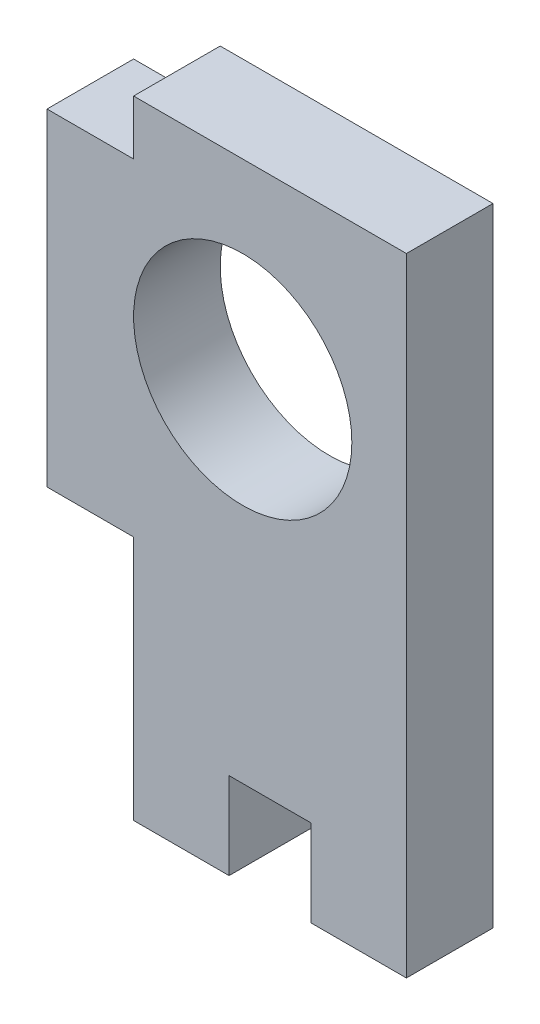
ISO-10303-21;
HEADER;
FILE_DESCRIPTION(('STEP AP214'),'2;1');
FILE_NAME('part.step','',(''),(''),'','','');
FILE_SCHEMA(('AUTOMOTIVE_DESIGN { 1 0 10303 214 1 1 1 1 }'));
ENDSEC;
DATA;
#1=APPLICATION_CONTEXT('core data for automotive mechanical design processes');
#2=APPLICATION_PROTOCOL_DEFINITION('international standard','automotive_design',2000,#1);
#3=PRODUCT_CONTEXT('',#1,'mechanical');
#4=PRODUCT('Part','Part','',(#3));
#5=PRODUCT_RELATED_PRODUCT_CATEGORY('part','',(#4));
#6=PRODUCT_DEFINITION_FORMATION('','',#4);
#7=PRODUCT_DEFINITION_CONTEXT('part definition',#1,'design');
#8=PRODUCT_DEFINITION('design','',#6,#7);
#9=PRODUCT_DEFINITION_SHAPE('','',#8);
#10=(LENGTH_UNIT() NAMED_UNIT(*) SI_UNIT(.MILLI.,.METRE.));
#11=(NAMED_UNIT(*) PLANE_ANGLE_UNIT() SI_UNIT($,.RADIAN.));
#12=(NAMED_UNIT(*) SI_UNIT($,.STERADIAN.) SOLID_ANGLE_UNIT());
#13=UNCERTAINTY_MEASURE_WITH_UNIT(LENGTH_MEASURE(1.E-05),#10,'distance_accuracy_value','');
#14=(GEOMETRIC_REPRESENTATION_CONTEXT(3) GLOBAL_UNCERTAINTY_ASSIGNED_CONTEXT((#13)) GLOBAL_UNIT_ASSIGNED_CONTEXT((#10,
#11,#12)) REPRESENTATION_CONTEXT('',''));
#15=CARTESIAN_POINT('',(0.,0.,0.));
#16=DIRECTION('',(0.,0.,1.));
#17=DIRECTION('',(1.,0.,0.));
#18=AXIS2_PLACEMENT_3D('',#15,#16,#17);
#19=CARTESIAN_POINT('',(-5.,9.5,-3.175));
#20=DIRECTION('',(1.,0.,0.));
#21=DIRECTION('',(0.,1.,0.));
#22=AXIS2_PLACEMENT_3D('',#19,#20,#21);
#23=PLANE('',#22);
#24=DIRECTION('',(0.,1.,0.));
#25=VECTOR('',#24,1.);
#26=CARTESIAN_POINT('',(-5.,9.5,0.));
#27=LINE('',#26,#25);
#28=CARTESIAN_POINT('',(-5.,9.5,0.));
#29=VERTEX_POINT('',#28);
#30=CARTESIAN_POINT('',(-5.,11.5,0.));
#31=VERTEX_POINT('',#30);
#32=EDGE_CURVE('E198',#29,#31,#27,.T.);
#33=ORIENTED_EDGE('',*,*,#32,.T.);
#34=DIRECTION('',(0.,0.,1.));
#35=VECTOR('',#34,1.);
#36=CARTESIAN_POINT('',(-5.,11.5,-3.175));
#37=LINE('',#36,#35);
#38=CARTESIAN_POINT('',(-5.,11.5,-3.175));
#39=VERTEX_POINT('',#38);
#40=EDGE_CURVE('E12',#39,#31,#37,.T.);
#41=ORIENTED_EDGE('',*,*,#40,.F.);
#42=DIRECTION('',(0.,1.,0.));
#43=VECTOR('',#42,1.);
#44=CARTESIAN_POINT('',(-5.,9.5,-3.175));
#45=LINE('',#44,#43);
#46=CARTESIAN_POINT('',(-5.,9.5,-3.175));
#47=VERTEX_POINT('',#46);
#48=EDGE_CURVE('E231',#47,#39,#45,.T.);
#49=ORIENTED_EDGE('',*,*,#48,.F.);
#50=DIRECTION('',(0.,0.,1.));
#51=VECTOR('',#50,1.);
#52=CARTESIAN_POINT('',(-5.,9.5,-3.175));
#53=LINE('',#52,#51);
#54=EDGE_CURVE('E93',#47,#29,#53,.T.);
#55=ORIENTED_EDGE('',*,*,#54,.T.);
#56=EDGE_LOOP('',(#33,#41,#49,#55));
#57=FACE_BOUND('',#56,.T.);
#58=ADVANCED_FACE('F77',(#57),#23,.F.);
#59=CARTESIAN_POINT('',(1.5,11.5,-3.175));
#60=DIRECTION('',(0.,-1.,0.));
#61=DIRECTION('',(1.,0.,0.));
#62=AXIS2_PLACEMENT_3D('',#59,#60,#61);
#63=PLANE('',#62);
#64=DIRECTION('',(1.,0.,0.));
#65=VECTOR('',#64,1.);
#66=CARTESIAN_POINT('',(1.5,11.5,0.));
#67=LINE('',#66,#65);
#68=CARTESIAN_POINT('',(5.,11.5,0.));
#69=VERTEX_POINT('',#68);
#70=EDGE_CURVE('E200',#31,#69,#67,.T.);
#71=ORIENTED_EDGE('',*,*,#70,.T.);
#72=DIRECTION('',(0.,0.,1.));
#73=VECTOR('',#72,1.);
#74=CARTESIAN_POINT('',(5.,11.5,-3.175));
#75=LINE('',#74,#73);
#76=CARTESIAN_POINT('',(5.,11.5,-3.175));
#77=VERTEX_POINT('',#76);
#78=EDGE_CURVE('E85',#77,#69,#75,.T.);
#79=ORIENTED_EDGE('',*,*,#78,.F.);
#80=DIRECTION('',(1.,0.,0.));
#81=VECTOR('',#80,1.);
#82=CARTESIAN_POINT('',(-5.,11.5,-3.175));
#83=LINE('',#82,#81);
#84=EDGE_CURVE('E143',#39,#77,#83,.T.);
#85=ORIENTED_EDGE('',*,*,#84,.F.);
#86=ORIENTED_EDGE('',*,*,#40,.T.);
#87=EDGE_LOOP('',(#71,#79,#85,#86));
#88=FACE_BOUND('',#87,.T.);
#89=ADVANCED_FACE('F252',(#88),#63,.F.);
#90=CARTESIAN_POINT('',(5.,-11.5,-3.175));
#91=DIRECTION('',(1.,0.,0.));
#92=DIRECTION('',(0.,0.,-1.));
#93=AXIS2_PLACEMENT_3D('',#90,#91,#92);
#94=PLANE('',#93);
#95=DIRECTION('',(0.,1.,0.));
#96=VECTOR('',#95,1.);
#97=CARTESIAN_POINT('',(5.,-11.5,0.));
#98=LINE('',#97,#96);
#99=CARTESIAN_POINT('',(5.,-11.5,0.));
#100=VERTEX_POINT('',#99);
#101=EDGE_CURVE('E204',#100,#69,#98,.T.);
#102=ORIENTED_EDGE('',*,*,#101,.F.);
#103=DIRECTION('',(0.,0.,1.));
#104=VECTOR('',#103,1.);
#105=CARTESIAN_POINT('',(5.,-11.5,-3.175));
#106=LINE('',#105,#104);
#107=CARTESIAN_POINT('',(5.,-11.5,-3.175));
#108=VERTEX_POINT('',#107);
#109=EDGE_CURVE('E245',#108,#100,#106,.T.);
#110=ORIENTED_EDGE('',*,*,#109,.F.);
#111=DIRECTION('',(0.,1.,0.));
#112=VECTOR('',#111,1.);
#113=CARTESIAN_POINT('',(5.,-11.5,-3.175));
#114=LINE('',#113,#112);
#115=EDGE_CURVE('E251',#108,#77,#114,.T.);
#116=ORIENTED_EDGE('',*,*,#115,.T.);
#117=ORIENTED_EDGE('',*,*,#78,.T.);
#118=EDGE_LOOP('',(#102,#110,#116,#117));
#119=FACE_BOUND('',#118,.T.);
#120=ADVANCED_FACE('F249',(#119),#94,.T.);
#121=CARTESIAN_POINT('',(1.5,-11.5,-3.175));
#122=DIRECTION('',(0.,-1.,0.));
#123=DIRECTION('',(0.,0.,-1.));
#124=AXIS2_PLACEMENT_3D('',#121,#122,#123);
#125=PLANE('',#124);
#126=DIRECTION('',(1.,0.,0.));
#127=VECTOR('',#126,1.);
#128=CARTESIAN_POINT('',(1.5,-11.5,0.));
#129=LINE('',#128,#127);
#130=CARTESIAN_POINT('',(1.5,-11.5,0.));
#131=VERTEX_POINT('',#130);
#132=EDGE_CURVE('E207',#131,#100,#129,.T.);
#133=ORIENTED_EDGE('',*,*,#132,.F.);
#134=DIRECTION('',(0.,0.,1.));
#135=VECTOR('',#134,1.);
#136=CARTESIAN_POINT('',(1.5,-11.5,-3.175));
#137=LINE('',#136,#135);
#138=CARTESIAN_POINT('',(1.5,-11.5,-3.175));
#139=VERTEX_POINT('',#138);
#140=EDGE_CURVE('E243',#139,#131,#137,.T.);
#141=ORIENTED_EDGE('',*,*,#140,.F.);
#142=DIRECTION('',(1.,0.,0.));
#143=VECTOR('',#142,1.);
#144=CARTESIAN_POINT('',(1.5,-11.5,-3.175));
#145=LINE('',#144,#143);
#146=EDGE_CURVE('E262',#139,#108,#145,.T.);
#147=ORIENTED_EDGE('',*,*,#146,.T.);
#148=ORIENTED_EDGE('',*,*,#109,.T.);
#149=EDGE_LOOP('',(#133,#141,#147,#148));
#150=FACE_BOUND('',#149,.T.);
#151=ADVANCED_FACE('F259',(#150),#125,.T.);
#152=CARTESIAN_POINT('',(1.5,-8.325,-3.175));
#153=DIRECTION('',(-1.,0.,0.));
#154=DIRECTION('',(0.,0.,1.));
#155=AXIS2_PLACEMENT_3D('',#152,#153,#154);
#156=PLANE('',#155);
#157=DIRECTION('',(0.,-1.,0.));
#158=VECTOR('',#157,1.);
#159=CARTESIAN_POINT('',(1.5,-8.325,0.));
#160=LINE('',#159,#158);
#161=CARTESIAN_POINT('',(1.5,-8.325,0.));
#162=VERTEX_POINT('',#161);
#163=EDGE_CURVE('E210',#162,#131,#160,.T.);
#164=ORIENTED_EDGE('',*,*,#163,.F.);
#165=DIRECTION('',(0.,0.,1.));
#166=VECTOR('',#165,1.);
#167=CARTESIAN_POINT('',(1.5,-8.325,-3.175));
#168=LINE('',#167,#166);
#169=CARTESIAN_POINT('',(1.5,-8.325,-3.175));
#170=VERTEX_POINT('',#169);
#171=EDGE_CURVE('E241',#170,#162,#168,.T.);
#172=ORIENTED_EDGE('',*,*,#171,.F.);
#173=DIRECTION('',(0.,-1.,0.));
#174=VECTOR('',#173,1.);
#175=CARTESIAN_POINT('',(1.5,-8.325,-3.175));
#176=LINE('',#175,#174);
#177=EDGE_CURVE('E266',#170,#139,#176,.T.);
#178=ORIENTED_EDGE('',*,*,#177,.T.);
#179=ORIENTED_EDGE('',*,*,#140,.T.);
#180=EDGE_LOOP('',(#164,#172,#178,#179));
#181=FACE_BOUND('',#180,.T.);
#182=ADVANCED_FACE('F383',(#181),#156,.T.);
#183=CARTESIAN_POINT('',(-1.5,-8.325,-3.175));
#184=DIRECTION('',(0.,-1.,0.));
#185=DIRECTION('',(0.,0.,-1.));
#186=AXIS2_PLACEMENT_3D('',#183,#184,#185);
#187=PLANE('',#186);
#188=DIRECTION('',(1.,0.,0.));
#189=VECTOR('',#188,1.);
#190=CARTESIAN_POINT('',(-1.5,-8.325,0.));
#191=LINE('',#190,#189);
#192=CARTESIAN_POINT('',(-1.5,-8.325,0.));
#193=VERTEX_POINT('',#192);
#194=EDGE_CURVE('E213',#193,#162,#191,.T.);
#195=ORIENTED_EDGE('',*,*,#194,.F.);
#196=DIRECTION('',(0.,0.,1.));
#197=VECTOR('',#196,1.);
#198=CARTESIAN_POINT('',(-1.5,-8.325,-3.175));
#199=LINE('',#198,#197);
#200=CARTESIAN_POINT('',(-1.5,-8.325,-3.175));
#201=VERTEX_POINT('',#200);
#202=EDGE_CURVE('E239',#201,#193,#199,.T.);
#203=ORIENTED_EDGE('',*,*,#202,.F.);
#204=DIRECTION('',(1.,0.,0.));
#205=VECTOR('',#204,1.);
#206=CARTESIAN_POINT('',(-1.5,-8.325,-3.175));
#207=LINE('',#206,#205);
#208=EDGE_CURVE('E272',#201,#170,#207,.T.);
#209=ORIENTED_EDGE('',*,*,#208,.T.);
#210=ORIENTED_EDGE('',*,*,#171,.T.);
#211=EDGE_LOOP('',(#195,#203,#209,#210));
#212=FACE_BOUND('',#211,.T.);
#213=ADVANCED_FACE('F374',(#212),#187,.T.);
#214=CARTESIAN_POINT('',(-1.5,-8.325,-3.175));
#215=DIRECTION('',(-1.,0.,0.));
#216=DIRECTION('',(0.,-1.,0.));
#217=AXIS2_PLACEMENT_3D('',#214,#215,#216);
#218=PLANE('',#217);
#219=DIRECTION('',(0.,-1.,0.));
#220=VECTOR('',#219,1.);
#221=CARTESIAN_POINT('',(-1.5,-8.325,0.));
#222=LINE('',#221,#220);
#223=CARTESIAN_POINT('',(-1.5,-11.5,0.));
#224=VERTEX_POINT('',#223);
#225=EDGE_CURVE('E216',#193,#224,#222,.T.);
#226=ORIENTED_EDGE('',*,*,#225,.T.);
#227=DIRECTION('',(0.,0.,1.));
#228=VECTOR('',#227,1.);
#229=CARTESIAN_POINT('',(-1.5,-11.5,-3.175));
#230=LINE('',#229,#228);
#231=CARTESIAN_POINT('',(-1.5,-11.5,-3.175));
#232=VERTEX_POINT('',#231);
#233=EDGE_CURVE('E237',#232,#224,#230,.T.);
#234=ORIENTED_EDGE('',*,*,#233,.F.);
#235=DIRECTION('',(0.,-1.,0.));
#236=VECTOR('',#235,1.);
#237=CARTESIAN_POINT('',(-1.5,-8.325,-3.175));
#238=LINE('',#237,#236);
#239=EDGE_CURVE('E275',#201,#232,#238,.T.);
#240=ORIENTED_EDGE('',*,*,#239,.F.);
#241=ORIENTED_EDGE('',*,*,#202,.T.);
#242=EDGE_LOOP('',(#226,#234,#240,#241));
#243=FACE_BOUND('',#242,.T.);
#244=ADVANCED_FACE('F286',(#243),#218,.F.);
#245=CARTESIAN_POINT('',(-5.,-11.5,-3.175));
#246=DIRECTION('',(0.,-1.,0.));
#247=DIRECTION('',(0.,0.,-1.));
#248=AXIS2_PLACEMENT_3D('',#245,#246,#247);
#249=PLANE('',#248);
#250=DIRECTION('',(1.,0.,0.));
#251=VECTOR('',#250,1.);
#252=CARTESIAN_POINT('',(-5.,-11.5,0.));
#253=LINE('',#252,#251);
#254=CARTESIAN_POINT('',(-5.,-11.5,0.));
#255=VERTEX_POINT('',#254);
#256=EDGE_CURVE('E219',#255,#224,#253,.T.);
#257=ORIENTED_EDGE('',*,*,#256,.F.);
#258=DIRECTION('',(0.,0.,1.));
#259=VECTOR('',#258,1.);
#260=CARTESIAN_POINT('',(-5.,-11.5,-3.175));
#261=LINE('',#260,#259);
#262=CARTESIAN_POINT('',(-5.,-11.5,-3.175));
#263=VERTEX_POINT('',#262);
#264=EDGE_CURVE('E235',#263,#255,#261,.T.);
#265=ORIENTED_EDGE('',*,*,#264,.F.);
#266=DIRECTION('',(1.,0.,0.));
#267=VECTOR('',#266,1.);
#268=CARTESIAN_POINT('',(-5.,-11.5,-3.175));
#269=LINE('',#268,#267);
#270=EDGE_CURVE('E277',#263,#232,#269,.T.);
#271=ORIENTED_EDGE('',*,*,#270,.T.);
#272=ORIENTED_EDGE('',*,*,#233,.T.);
#273=EDGE_LOOP('',(#257,#265,#271,#272));
#274=FACE_BOUND('',#273,.T.);
#275=ADVANCED_FACE('F281',(#274),#249,.T.);
#276=CARTESIAN_POINT('',(-5.,-11.5,-3.175));
#277=DIRECTION('',(1.,0.,0.));
#278=DIRECTION('',(0.,1.,0.));
#279=AXIS2_PLACEMENT_3D('',#276,#277,#278);
#280=PLANE('',#279);
#281=DIRECTION('',(0.,1.,0.));
#282=VECTOR('',#281,1.);
#283=CARTESIAN_POINT('',(-5.,-11.5,0.));
#284=LINE('',#283,#282);
#285=CARTESIAN_POINT('',(-5.,-2.5,0.));
#286=VERTEX_POINT('',#285);
#287=EDGE_CURVE('E222',#255,#286,#284,.T.);
#288=ORIENTED_EDGE('',*,*,#287,.T.);
#289=DIRECTION('',(0.,0.,1.));
#290=VECTOR('',#289,1.);
#291=CARTESIAN_POINT('',(-5.,-2.5,-3.175));
#292=LINE('',#291,#290);
#293=CARTESIAN_POINT('',(-5.,-2.5,-3.175));
#294=VERTEX_POINT('',#293);
#295=EDGE_CURVE('E180',#294,#286,#292,.T.);
#296=ORIENTED_EDGE('',*,*,#295,.F.);
#297=DIRECTION('',(0.,1.,0.));
#298=VECTOR('',#297,1.);
#299=CARTESIAN_POINT('',(-5.,-11.5,-3.175));
#300=LINE('',#299,#298);
#301=EDGE_CURVE('E189',#263,#294,#300,.T.);
#302=ORIENTED_EDGE('',*,*,#301,.F.);
#303=ORIENTED_EDGE('',*,*,#264,.T.);
#304=EDGE_LOOP('',(#288,#296,#302,#303));
#305=FACE_BOUND('',#304,.T.);
#306=ADVANCED_FACE('F291',(#305),#280,.F.);
#307=CARTESIAN_POINT('',(-8.175,-2.5,-3.175));
#308=DIRECTION('',(0.,-1.,0.));
#309=DIRECTION('',(1.,0.,0.));
#310=AXIS2_PLACEMENT_3D('',#307,#308,#309);
#311=PLANE('',#310);
#312=DIRECTION('',(1.,0.,0.));
#313=VECTOR('',#312,1.);
#314=CARTESIAN_POINT('',(-8.175,-2.5,0.));
#315=LINE('',#314,#313);
#316=CARTESIAN_POINT('',(-8.175,-2.5,0.));
#317=VERTEX_POINT('',#316);
#318=EDGE_CURVE('E176',#317,#286,#315,.T.);
#319=ORIENTED_EDGE('',*,*,#318,.F.);
#320=DIRECTION('',(0.,0.,1.));
#321=VECTOR('',#320,1.);
#322=CARTESIAN_POINT('',(-8.175,-2.5,-3.175));
#323=LINE('',#322,#321);
#324=CARTESIAN_POINT('',(-8.175,-2.5,-3.175));
#325=VERTEX_POINT('',#324);
#326=EDGE_CURVE('E171',#325,#317,#323,.T.);
#327=ORIENTED_EDGE('',*,*,#326,.F.);
#328=DIRECTION('',(1.,0.,0.));
#329=VECTOR('',#328,1.);
#330=CARTESIAN_POINT('',(-8.175,-2.5,-3.175));
#331=LINE('',#330,#329);
#332=EDGE_CURVE('E174',#325,#294,#331,.T.);
#333=ORIENTED_EDGE('',*,*,#332,.T.);
#334=ORIENTED_EDGE('',*,*,#295,.T.);
#335=EDGE_LOOP('',(#319,#327,#333,#334));
#336=FACE_BOUND('',#335,.T.);
#337=ADVANCED_FACE('F173',(#336),#311,.T.);
#338=CARTESIAN_POINT('',(-8.175,9.5,-3.175));
#339=DIRECTION('',(-1.,0.,0.));
#340=DIRECTION('',(0.,0.,1.));
#341=AXIS2_PLACEMENT_3D('',#338,#339,#340);
#342=PLANE('',#341);
#343=DIRECTION('',(0.,-1.,0.));
#344=VECTOR('',#343,1.);
#345=CARTESIAN_POINT('',(-8.175,9.5,0.));
#346=LINE('',#345,#344);
#347=CARTESIAN_POINT('',(-8.175,9.5,0.));
#348=VERTEX_POINT('',#347);
#349=EDGE_CURVE('E226',#348,#317,#346,.T.);
#350=ORIENTED_EDGE('',*,*,#349,.F.);
#351=DIRECTION('',(0.,0.,1.));
#352=VECTOR('',#351,1.);
#353=CARTESIAN_POINT('',(-8.175,9.5,-3.175));
#354=LINE('',#353,#352);
#355=CARTESIAN_POINT('',(-8.175,9.5,-3.175));
#356=VERTEX_POINT('',#355);
#357=EDGE_CURVE('E131',#356,#348,#354,.T.);
#358=ORIENTED_EDGE('',*,*,#357,.F.);
#359=DIRECTION('',(0.,-1.,0.));
#360=VECTOR('',#359,1.);
#361=CARTESIAN_POINT('',(-8.175,9.5,-3.175));
#362=LINE('',#361,#360);
#363=EDGE_CURVE('E186',#356,#325,#362,.T.);
#364=ORIENTED_EDGE('',*,*,#363,.T.);
#365=ORIENTED_EDGE('',*,*,#326,.T.);
#366=EDGE_LOOP('',(#350,#358,#364,#365));
#367=FACE_BOUND('',#366,.T.);
#368=ADVANCED_FACE('F192',(#367),#342,.T.);
#369=CARTESIAN_POINT('',(-5.,9.5,-3.175));
#370=DIRECTION('',(0.,1.,0.));
#371=DIRECTION('',(0.,0.,1.));
#372=AXIS2_PLACEMENT_3D('',#369,#370,#371);
#373=PLANE('',#372);
#374=DIRECTION('',(-1.,0.,0.));
#375=VECTOR('',#374,1.);
#376=CARTESIAN_POINT('',(-5.,9.5,0.));
#377=LINE('',#376,#375);
#378=EDGE_CURVE('E228',#29,#348,#377,.T.);
#379=ORIENTED_EDGE('',*,*,#378,.F.);
#380=ORIENTED_EDGE('',*,*,#54,.F.);
#381=DIRECTION('',(-1.,0.,0.));
#382=VECTOR('',#381,1.);
#383=CARTESIAN_POINT('',(-5.,9.5,-3.175));
#384=LINE('',#383,#382);
#385=EDGE_CURVE('E193',#47,#356,#384,.T.);
#386=ORIENTED_EDGE('',*,*,#385,.T.);
#387=ORIENTED_EDGE('',*,*,#357,.T.);
#388=EDGE_LOOP('',(#379,#380,#386,#387));
#389=FACE_BOUND('',#388,.T.);
#390=ADVANCED_FACE('F304',(#389),#373,.T.);
#391=CARTESIAN_POINT('',(0.,0.,-3.175));
#392=DIRECTION('',(0.,0.,-1.));
#393=DIRECTION('',(-1.,0.,0.));
#394=AXIS2_PLACEMENT_3D('',#391,#392,#393);
#395=PLANE('',#394);
#396=CARTESIAN_POINT('',(-0.999999999999998,4.5,-3.175));
#397=DIRECTION('',(0.,0.,1.));
#398=DIRECTION('',(1.,0.,0.));
#399=AXIS2_PLACEMENT_3D('',#396,#397,#398);
#400=CIRCLE('',#399,4.00000000000001);
#401=CARTESIAN_POINT('',(3.00000000000001,4.5,-3.175));
#402=VERTEX_POINT('',#401);
#403=EDGE_CURVE('E201',#402,#402,#400,.T.);
#404=ORIENTED_EDGE('',*,*,#403,.T.);
#405=EDGE_LOOP('',(#404));
#406=FACE_BOUND('',#405,.T.);
#407=ORIENTED_EDGE('',*,*,#48,.T.);
#408=ORIENTED_EDGE('',*,*,#84,.T.);
#409=ORIENTED_EDGE('',*,*,#115,.F.);
#410=ORIENTED_EDGE('',*,*,#146,.F.);
#411=ORIENTED_EDGE('',*,*,#177,.F.);
#412=ORIENTED_EDGE('',*,*,#208,.F.);
#413=ORIENTED_EDGE('',*,*,#239,.T.);
#414=ORIENTED_EDGE('',*,*,#270,.F.);
#415=ORIENTED_EDGE('',*,*,#301,.T.);
#416=ORIENTED_EDGE('',*,*,#332,.F.);
#417=ORIENTED_EDGE('',*,*,#363,.F.);
#418=ORIENTED_EDGE('',*,*,#385,.F.);
#419=EDGE_LOOP('',(#407,#408,#409,#410,#411,#412,#413,#414,#415,#416,#417,#418));
#420=FACE_BOUND('',#419,.T.);
#421=ADVANCED_FACE('F184',(#406,#420),#395,.T.);
#422=CARTESIAN_POINT('',(0.,0.,0.));
#423=DIRECTION('',(0.,0.,-1.));
#424=DIRECTION('',(-1.,0.,0.));
#425=AXIS2_PLACEMENT_3D('',#422,#423,#424);
#426=PLANE('',#425);
#427=CARTESIAN_POINT('',(-0.999999999999998,4.5,0.));
#428=DIRECTION('',(0.,0.,1.));
#429=DIRECTION('',(1.,0.,0.));
#430=AXIS2_PLACEMENT_3D('',#427,#428,#429);
#431=CIRCLE('',#430,4.00000000000001);
#432=CARTESIAN_POINT('',(3.00000000000001,4.5,0.));
#433=VERTEX_POINT('',#432);
#434=EDGE_CURVE('E328',#433,#433,#431,.T.);
#435=ORIENTED_EDGE('',*,*,#434,.F.);
#436=EDGE_LOOP('',(#435));
#437=FACE_BOUND('',#436,.T.);
#438=ORIENTED_EDGE('',*,*,#32,.F.);
#439=ORIENTED_EDGE('',*,*,#378,.T.);
#440=ORIENTED_EDGE('',*,*,#349,.T.);
#441=ORIENTED_EDGE('',*,*,#318,.T.);
#442=ORIENTED_EDGE('',*,*,#287,.F.);
#443=ORIENTED_EDGE('',*,*,#256,.T.);
#444=ORIENTED_EDGE('',*,*,#225,.F.);
#445=ORIENTED_EDGE('',*,*,#194,.T.);
#446=ORIENTED_EDGE('',*,*,#163,.T.);
#447=ORIENTED_EDGE('',*,*,#132,.T.);
#448=ORIENTED_EDGE('',*,*,#101,.T.);
#449=ORIENTED_EDGE('',*,*,#70,.F.);
#450=EDGE_LOOP('',(#438,#439,#440,#441,#442,#443,#444,#445,#446,#447,#448,#449));
#451=FACE_BOUND('',#450,.T.);
#452=ADVANCED_FACE('F255',(#437,#451),#426,.F.);
#453=CARTESIAN_POINT('',(-0.999999999999998,4.5,-3.175));
#454=DIRECTION('',(0.,0.,1.));
#455=DIRECTION('',(1.,0.,0.));
#456=AXIS2_PLACEMENT_3D('',#453,#454,#455);
#457=CYLINDRICAL_SURFACE('',#456,4.00000000000001);
#458=ORIENTED_EDGE('',*,*,#403,.F.);
#459=EDGE_LOOP('',(#458));
#460=FACE_BOUND('',#459,.T.);
#461=ORIENTED_EDGE('',*,*,#434,.T.);
#462=EDGE_LOOP('',(#461));
#463=FACE_BOUND('',#462,.T.);
#464=ADVANCED_FACE('F316',(#460,#463),#457,.F.);
#465=CLOSED_SHELL('',(#58,#89,#120,#151,#182,#213,#244,#275,#306,#337,#368,#390,#421,#452,#464));
#466=MANIFOLD_SOLID_BREP('B2',#465);
#467=ADVANCED_BREP_SHAPE_REPRESENTATION('',(#18,#466),#14);
#468=SHAPE_DEFINITION_REPRESENTATION(#9,#467);
ENDSEC;
END-ISO-10303-21;
